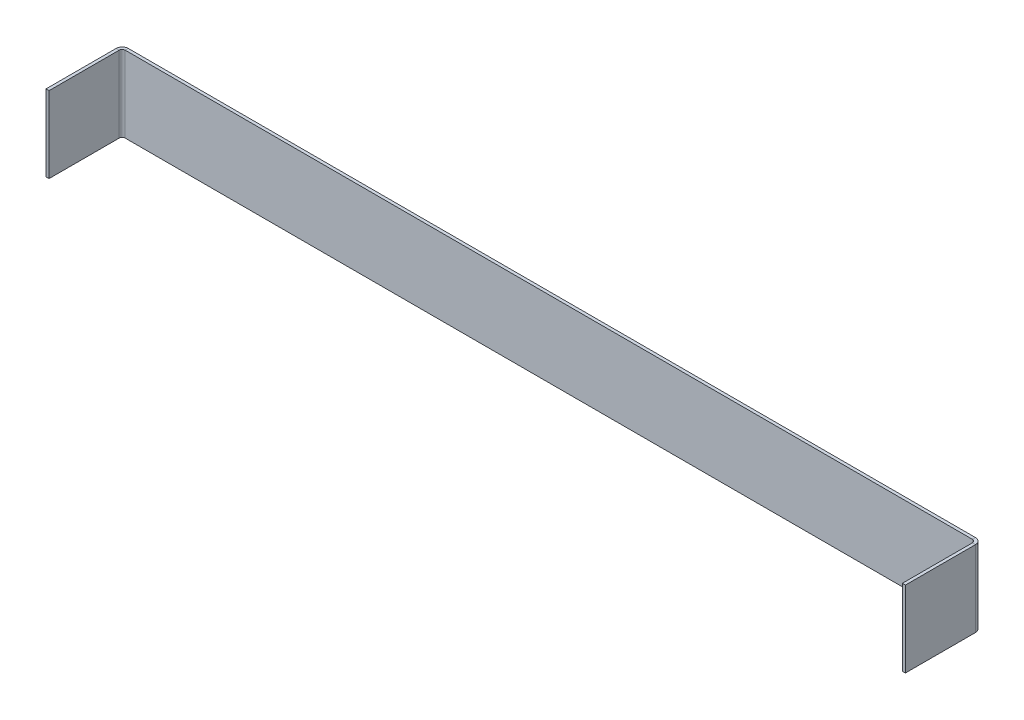
ISO-10303-21;
HEADER;
FILE_DESCRIPTION(('STEP AP214'),'2;1');
FILE_NAME('part.step','',(''),(''),'','','');
FILE_SCHEMA(('AUTOMOTIVE_DESIGN { 1 0 10303 214 1 1 1 1 }'));
ENDSEC;
DATA;
#1=APPLICATION_CONTEXT('core data for automotive mechanical design processes');
#2=APPLICATION_PROTOCOL_DEFINITION('international standard','automotive_design',2000,#1);
#3=PRODUCT_CONTEXT('',#1,'mechanical');
#4=PRODUCT('Part','Part','',(#3));
#5=PRODUCT_RELATED_PRODUCT_CATEGORY('part','',(#4));
#6=PRODUCT_DEFINITION_FORMATION('','',#4);
#7=PRODUCT_DEFINITION_CONTEXT('part definition',#1,'design');
#8=PRODUCT_DEFINITION('design','',#6,#7);
#9=PRODUCT_DEFINITION_SHAPE('','',#8);
#10=(LENGTH_UNIT() NAMED_UNIT(*) SI_UNIT(.MILLI.,.METRE.));
#11=(NAMED_UNIT(*) PLANE_ANGLE_UNIT() SI_UNIT($,.RADIAN.));
#12=(NAMED_UNIT(*) SI_UNIT($,.STERADIAN.) SOLID_ANGLE_UNIT());
#13=UNCERTAINTY_MEASURE_WITH_UNIT(LENGTH_MEASURE(1.E-05),#10,'distance_accuracy_value','');
#14=(GEOMETRIC_REPRESENTATION_CONTEXT(3) GLOBAL_UNCERTAINTY_ASSIGNED_CONTEXT((#13)) GLOBAL_UNIT_ASSIGNED_CONTEXT((#10,
#11,#12)) REPRESENTATION_CONTEXT('',''));
#15=CARTESIAN_POINT('',(0.,0.,0.));
#16=DIRECTION('',(0.,0.,1.));
#17=DIRECTION('',(1.,0.,0.));
#18=AXIS2_PLACEMENT_3D('',#15,#16,#17);
#19=CARTESIAN_POINT('',(0.,0.,2.));
#20=DIRECTION('',(0.,1.,0.));
#21=DIRECTION('',(0.,0.,1.));
#22=AXIS2_PLACEMENT_3D('',#19,#20,#21);
#23=PLANE('',#22);
#24=DIRECTION('',(0.,0.,-1.));
#25=VECTOR('',#24,1.);
#26=CARTESIAN_POINT('',(560.,0.,2.00000000000001));
#27=LINE('',#26,#25);
#28=CARTESIAN_POINT('',(560.,0.,2.00000000000001));
#29=VERTEX_POINT('',#28);
#30=CARTESIAN_POINT('',(560.,0.,0.));
#31=VERTEX_POINT('',#30);
#32=EDGE_CURVE('E226',#29,#31,#27,.T.);
#33=ORIENTED_EDGE('',*,*,#32,.F.);
#34=DIRECTION('',(1.,0.,0.));
#35=VECTOR('',#34,1.);
#36=CARTESIAN_POINT('',(0.,0.,2.));
#37=LINE('',#36,#35);
#38=CARTESIAN_POINT('',(3.99999999999999,0.,2.));
#39=VERTEX_POINT('',#38);
#40=EDGE_CURVE('E87',#39,#29,#37,.T.);
#41=ORIENTED_EDGE('',*,*,#40,.F.);
#42=DIRECTION('',(0.,0.,-1.));
#43=VECTOR('',#42,1.);
#44=CARTESIAN_POINT('',(3.99999999999999,0.,2.));
#45=LINE('',#44,#43);
#46=CARTESIAN_POINT('',(3.99999999999999,0.,0.));
#47=VERTEX_POINT('',#46);
#48=EDGE_CURVE('E267',#39,#47,#45,.T.);
#49=ORIENTED_EDGE('',*,*,#48,.T.);
#50=DIRECTION('',(1.,0.,0.));
#51=VECTOR('',#50,1.);
#52=CARTESIAN_POINT('',(0.,0.,0.));
#53=LINE('',#52,#51);
#54=EDGE_CURVE('E281',#47,#31,#53,.T.);
#55=ORIENTED_EDGE('',*,*,#54,.T.);
#56=EDGE_LOOP('',(#33,#41,#49,#55));
#57=FACE_BOUND('',#56,.T.);
#58=ADVANCED_FACE('F79',(#57),#23,.F.);
#59=CARTESIAN_POINT('',(0.,50.,2.));
#60=DIRECTION('',(0.,-1.,0.));
#61=DIRECTION('',(0.,0.,-1.));
#62=AXIS2_PLACEMENT_3D('',#59,#60,#61);
#63=PLANE('',#62);
#64=DIRECTION('',(0.,0.,-1.));
#65=VECTOR('',#64,1.);
#66=CARTESIAN_POINT('',(560.,50.,2.00000000000001));
#67=LINE('',#66,#65);
#68=CARTESIAN_POINT('',(560.,50.,2.00000000000001));
#69=VERTEX_POINT('',#68);
#70=CARTESIAN_POINT('',(560.,50.,0.));
#71=VERTEX_POINT('',#70);
#72=EDGE_CURVE('E215',#69,#71,#67,.T.);
#73=ORIENTED_EDGE('',*,*,#72,.T.);
#74=DIRECTION('',(-1.,0.,0.));
#75=VECTOR('',#74,1.);
#76=CARTESIAN_POINT('',(0.,50.,0.));
#77=LINE('',#76,#75);
#78=CARTESIAN_POINT('',(3.99999999999999,50.,0.));
#79=VERTEX_POINT('',#78);
#80=EDGE_CURVE('E82',#71,#79,#77,.T.);
#81=ORIENTED_EDGE('',*,*,#80,.T.);
#82=DIRECTION('',(0.,0.,-1.));
#83=VECTOR('',#82,1.);
#84=CARTESIAN_POINT('',(3.99999999999999,50.,2.));
#85=LINE('',#84,#83);
#86=CARTESIAN_POINT('',(3.99999999999999,50.,2.));
#87=VERTEX_POINT('',#86);
#88=EDGE_CURVE('E278',#87,#79,#85,.T.);
#89=ORIENTED_EDGE('',*,*,#88,.F.);
#90=DIRECTION('',(-1.,0.,0.));
#91=VECTOR('',#90,1.);
#92=CARTESIAN_POINT('',(0.,50.,2.));
#93=LINE('',#92,#91);
#94=EDGE_CURVE('E13',#69,#87,#93,.T.);
#95=ORIENTED_EDGE('',*,*,#94,.F.);
#96=EDGE_LOOP('',(#73,#81,#89,#95));
#97=FACE_BOUND('',#96,.T.);
#98=ADVANCED_FACE('F298',(#97),#63,.F.);
#99=CARTESIAN_POINT('',(0.,0.,2.));
#100=DIRECTION('',(0.,0.,-1.));
#101=DIRECTION('',(-1.,0.,0.));
#102=AXIS2_PLACEMENT_3D('',#99,#100,#101);
#103=PLANE('',#102);
#104=DIRECTION('',(0.,1.,0.));
#105=VECTOR('',#104,1.);
#106=CARTESIAN_POINT('',(560.,50.,2.00000000000001));
#107=LINE('',#106,#105);
#108=EDGE_CURVE('E221',#69,#29,#107,.F.);
#109=ORIENTED_EDGE('',*,*,#108,.F.);
#110=ORIENTED_EDGE('',*,*,#94,.T.);
#111=DIRECTION('',(0.,-1.,0.));
#112=VECTOR('',#111,1.);
#113=CARTESIAN_POINT('',(3.99999999999999,0.,2.));
#114=LINE('',#113,#112);
#115=EDGE_CURVE('E273',#39,#87,#114,.F.);
#116=ORIENTED_EDGE('',*,*,#115,.F.);
#117=ORIENTED_EDGE('',*,*,#40,.T.);
#118=EDGE_LOOP('',(#109,#110,#116,#117));
#119=FACE_BOUND('',#118,.T.);
#120=ADVANCED_FACE('F302',(#119),#103,.F.);
#121=CARTESIAN_POINT('',(0.,0.,0.));
#122=DIRECTION('',(0.,0.,-1.));
#123=DIRECTION('',(-1.,0.,0.));
#124=AXIS2_PLACEMENT_3D('',#121,#122,#123);
#125=PLANE('',#124);
#126=ORIENTED_EDGE('',*,*,#80,.F.);
#127=DIRECTION('',(0.,1.,0.));
#128=VECTOR('',#127,1.);
#129=CARTESIAN_POINT('',(560.,50.,0.));
#130=LINE('',#129,#128);
#131=EDGE_CURVE('E210',#71,#31,#130,.F.);
#132=ORIENTED_EDGE('',*,*,#131,.T.);
#133=ORIENTED_EDGE('',*,*,#54,.F.);
#134=DIRECTION('',(0.,-1.,0.));
#135=VECTOR('',#134,1.);
#136=CARTESIAN_POINT('',(3.99999999999999,0.,0.));
#137=LINE('',#136,#135);
#138=EDGE_CURVE('E260',#47,#79,#137,.F.);
#139=ORIENTED_EDGE('',*,*,#138,.T.);
#140=EDGE_LOOP('',(#126,#132,#133,#139));
#141=FACE_BOUND('',#140,.T.);
#142=ADVANCED_FACE('F291',(#141),#125,.T.);
#143=CARTESIAN_POINT('',(3.99999999999999,50.,4.));
#144=DIRECTION('',(0.,1.,0.));
#145=DIRECTION('',(0.,0.,1.));
#146=AXIS2_PLACEMENT_3D('',#143,#144,#145);
#147=PLANE('',#146);
#148=DIRECTION('',(1.,0.,0.));
#149=VECTOR('',#148,1.);
#150=CARTESIAN_POINT('',(0.,50.,3.99999999999999));
#151=LINE('',#150,#149);
#152=CARTESIAN_POINT('',(1.99999999999999,50.,3.99999999999999));
#153=VERTEX_POINT('',#152);
#154=CARTESIAN_POINT('',(0.,50.,3.99999999999999));
#155=VERTEX_POINT('',#154);
#156=EDGE_CURVE('E228',#153,#155,#151,.F.);
#157=ORIENTED_EDGE('',*,*,#156,.F.);
#158=CARTESIAN_POINT('',(3.99999999999999,50.,4.));
#159=DIRECTION('',(0.,-1.,0.));
#160=DIRECTION('',(0.,0.,-1.));
#161=AXIS2_PLACEMENT_3D('',#158,#159,#160);
#162=CIRCLE('',#161,2.);
#163=EDGE_CURVE('E270',#87,#153,#162,.F.);
#164=ORIENTED_EDGE('',*,*,#163,.F.);
#165=ORIENTED_EDGE('',*,*,#88,.T.);
#166=CARTESIAN_POINT('',(3.99999999999999,50.,4.));
#167=DIRECTION('',(0.,-1.,0.));
#168=DIRECTION('',(0.,0.,-1.));
#169=AXIS2_PLACEMENT_3D('',#166,#167,#168);
#170=CIRCLE('',#169,4.);
#171=EDGE_CURVE('E263',#79,#155,#170,.F.);
#172=ORIENTED_EDGE('',*,*,#171,.T.);
#173=EDGE_LOOP('',(#157,#164,#165,#172));
#174=FACE_BOUND('',#173,.T.);
#175=ADVANCED_FACE('F309',(#174),#147,.T.);
#176=CARTESIAN_POINT('',(3.99999999999999,0.,4.));
#177=DIRECTION('',(0.,1.,0.));
#178=DIRECTION('',(0.,0.,1.));
#179=AXIS2_PLACEMENT_3D('',#176,#177,#178);
#180=PLANE('',#179);
#181=CARTESIAN_POINT('',(3.99999999999999,0.,4.));
#182=DIRECTION('',(0.,-1.,0.));
#183=DIRECTION('',(0.,0.,-1.));
#184=AXIS2_PLACEMENT_3D('',#181,#182,#183);
#185=CIRCLE('',#184,2.);
#186=CARTESIAN_POINT('',(1.99999999999999,0.,3.99999999999999));
#187=VERTEX_POINT('',#186);
#188=EDGE_CURVE('E233',#187,#39,#185,.T.);
#189=ORIENTED_EDGE('',*,*,#188,.F.);
#190=DIRECTION('',(1.,0.,0.));
#191=VECTOR('',#190,1.);
#192=CARTESIAN_POINT('',(1.99999999999999,0.,3.99999999999999));
#193=LINE('',#192,#191);
#194=CARTESIAN_POINT('',(0.,0.,3.99999999999999));
#195=VERTEX_POINT('',#194);
#196=EDGE_CURVE('E253',#187,#195,#193,.F.);
#197=ORIENTED_EDGE('',*,*,#196,.T.);
#198=CARTESIAN_POINT('',(3.99999999999999,0.,4.));
#199=DIRECTION('',(0.,-1.,0.));
#200=DIRECTION('',(0.,0.,-1.));
#201=AXIS2_PLACEMENT_3D('',#198,#199,#200);
#202=CIRCLE('',#201,4.);
#203=EDGE_CURVE('E264',#195,#47,#202,.T.);
#204=ORIENTED_EDGE('',*,*,#203,.T.);
#205=ORIENTED_EDGE('',*,*,#48,.F.);
#206=EDGE_LOOP('',(#189,#197,#204,#205));
#207=FACE_BOUND('',#206,.T.);
#208=ADVANCED_FACE('F329',(#207),#180,.F.);
#209=CARTESIAN_POINT('',(3.99999999999999,0.,4.));
#210=DIRECTION('',(0.,-1.,0.));
#211=DIRECTION('',(-1.,0.,0.));
#212=AXIS2_PLACEMENT_3D('',#209,#210,#211);
#213=CYLINDRICAL_SURFACE('',#212,4.);
#214=ORIENTED_EDGE('',*,*,#138,.F.);
#215=ORIENTED_EDGE('',*,*,#203,.F.);
#216=DIRECTION('',(0.,-1.,0.));
#217=VECTOR('',#216,1.);
#218=CARTESIAN_POINT('',(0.,50.,3.99999999999999));
#219=LINE('',#218,#217);
#220=EDGE_CURVE('E251',#195,#155,#219,.F.);
#221=ORIENTED_EDGE('',*,*,#220,.T.);
#222=ORIENTED_EDGE('',*,*,#171,.F.);
#223=EDGE_LOOP('',(#214,#215,#221,#222));
#224=FACE_BOUND('',#223,.T.);
#225=ADVANCED_FACE('F354',(#224),#213,.T.);
#226=CARTESIAN_POINT('',(3.99999999999999,0.,4.));
#227=DIRECTION('',(0.,-1.,0.));
#228=DIRECTION('',(-1.,0.,0.));
#229=AXIS2_PLACEMENT_3D('',#226,#227,#228);
#230=CYLINDRICAL_SURFACE('',#229,2.);
#231=ORIENTED_EDGE('',*,*,#115,.T.);
#232=ORIENTED_EDGE('',*,*,#163,.T.);
#233=DIRECTION('',(0.,-1.,0.));
#234=VECTOR('',#233,1.);
#235=CARTESIAN_POINT('',(1.99999999999999,50.,3.99999999999999));
#236=LINE('',#235,#234);
#237=EDGE_CURVE('E256',#153,#187,#236,.T.);
#238=ORIENTED_EDGE('',*,*,#237,.T.);
#239=ORIENTED_EDGE('',*,*,#188,.T.);
#240=EDGE_LOOP('',(#231,#232,#238,#239));
#241=FACE_BOUND('',#240,.T.);
#242=ADVANCED_FACE('F305',(#241),#230,.F.);
#243=CARTESIAN_POINT('',(0.,50.,1.99999999999999));
#244=DIRECTION('',(0.,-1.,0.));
#245=DIRECTION('',(0.,0.,-1.));
#246=AXIS2_PLACEMENT_3D('',#243,#244,#245);
#247=PLANE('',#246);
#248=ORIENTED_EDGE('',*,*,#156,.T.);
#249=DIRECTION('',(0.,0.,-1.));
#250=VECTOR('',#249,1.);
#251=CARTESIAN_POINT('',(0.,50.,0.));
#252=LINE('',#251,#250);
#253=CARTESIAN_POINT('',(-1.6763517303825E-13,50.,50.));
#254=VERTEX_POINT('',#253);
#255=EDGE_CURVE('E241',#254,#155,#252,.T.);
#256=ORIENTED_EDGE('',*,*,#255,.F.);
#257=DIRECTION('',(1.,0.,0.));
#258=VECTOR('',#257,1.);
#259=CARTESIAN_POINT('',(-1.6759110426447E-13,50.,50.));
#260=LINE('',#259,#258);
#261=CARTESIAN_POINT('',(1.99999999999983,50.,50.));
#262=VERTEX_POINT('',#261);
#263=EDGE_CURVE('E234',#254,#262,#260,.T.);
#264=ORIENTED_EDGE('',*,*,#263,.T.);
#265=DIRECTION('',(0.,0.,1.));
#266=VECTOR('',#265,1.);
#267=CARTESIAN_POINT('',(2.,50.,2.));
#268=LINE('',#267,#266);
#269=EDGE_CURVE('E248',#262,#153,#268,.F.);
#270=ORIENTED_EDGE('',*,*,#269,.T.);
#271=EDGE_LOOP('',(#248,#256,#264,#270));
#272=FACE_BOUND('',#271,.T.);
#273=ADVANCED_FACE('F312',(#272),#247,.F.);
#274=CARTESIAN_POINT('',(-1.67400815431762E-13,0.,50.));
#275=DIRECTION('',(0.,1.,0.));
#276=DIRECTION('',(0.,0.,1.));
#277=AXIS2_PLACEMENT_3D('',#274,#275,#276);
#278=PLANE('',#277);
#279=ORIENTED_EDGE('',*,*,#196,.F.);
#280=DIRECTION('',(0.,0.,-1.));
#281=VECTOR('',#280,1.);
#282=CARTESIAN_POINT('',(1.99999999999983,0.,50.));
#283=LINE('',#282,#281);
#284=CARTESIAN_POINT('',(1.99999999999983,0.,50.));
#285=VERTEX_POINT('',#284);
#286=EDGE_CURVE('E246',#187,#285,#283,.F.);
#287=ORIENTED_EDGE('',*,*,#286,.T.);
#288=DIRECTION('',(1.,0.,0.));
#289=VECTOR('',#288,1.);
#290=CARTESIAN_POINT('',(-1.67400815431762E-13,0.,50.));
#291=LINE('',#290,#289);
#292=CARTESIAN_POINT('',(-1.6763517303825E-13,0.,50.));
#293=VERTEX_POINT('',#292);
#294=EDGE_CURVE('E230',#293,#285,#291,.T.);
#295=ORIENTED_EDGE('',*,*,#294,.F.);
#296=DIRECTION('',(0.,0.,1.));
#297=VECTOR('',#296,1.);
#298=CARTESIAN_POINT('',(0.,0.,0.));
#299=LINE('',#298,#297);
#300=EDGE_CURVE('E239',#195,#293,#299,.T.);
#301=ORIENTED_EDGE('',*,*,#300,.F.);
#302=EDGE_LOOP('',(#279,#287,#295,#301));
#303=FACE_BOUND('',#302,.T.);
#304=ADVANCED_FACE('F331',(#303),#278,.F.);
#305=CARTESIAN_POINT('',(0.,0.,0.));
#306=DIRECTION('',(1.,0.,0.));
#307=DIRECTION('',(0.,0.,-1.));
#308=AXIS2_PLACEMENT_3D('',#305,#306,#307);
#309=PLANE('',#308);
#310=ORIENTED_EDGE('',*,*,#220,.F.);
#311=ORIENTED_EDGE('',*,*,#300,.T.);
#312=DIRECTION('',(0.,1.,0.));
#313=VECTOR('',#312,1.);
#314=CARTESIAN_POINT('',(-1.6763517303825E-13,0.,50.));
#315=LINE('',#314,#313);
#316=EDGE_CURVE('E237',#293,#254,#315,.T.);
#317=ORIENTED_EDGE('',*,*,#316,.T.);
#318=ORIENTED_EDGE('',*,*,#255,.T.);
#319=EDGE_LOOP('',(#310,#311,#317,#318));
#320=FACE_BOUND('',#319,.T.);
#321=ADVANCED_FACE('F316',(#320),#309,.F.);
#322=CARTESIAN_POINT('',(2.00000000000001,0.,0.));
#323=DIRECTION('',(1.,0.,0.));
#324=DIRECTION('',(0.,0.,-1.));
#325=AXIS2_PLACEMENT_3D('',#322,#323,#324);
#326=PLANE('',#325);
#327=ORIENTED_EDGE('',*,*,#286,.F.);
#328=ORIENTED_EDGE('',*,*,#237,.F.);
#329=ORIENTED_EDGE('',*,*,#269,.F.);
#330=DIRECTION('',(0.,-1.,0.));
#331=VECTOR('',#330,1.);
#332=CARTESIAN_POINT('',(1.99999999999983,50.,50.));
#333=LINE('',#332,#331);
#334=EDGE_CURVE('E244',#285,#262,#333,.F.);
#335=ORIENTED_EDGE('',*,*,#334,.F.);
#336=EDGE_LOOP('',(#327,#328,#329,#335));
#337=FACE_BOUND('',#336,.T.);
#338=ADVANCED_FACE('F326',(#337),#326,.T.);
#339=CARTESIAN_POINT('',(-1.67400815431762E-13,50.,50.));
#340=DIRECTION('',(0.,0.,-1.));
#341=DIRECTION('',(-1.,0.,0.));
#342=AXIS2_PLACEMENT_3D('',#339,#340,#341);
#343=PLANE('',#342);
#344=ORIENTED_EDGE('',*,*,#334,.T.);
#345=ORIENTED_EDGE('',*,*,#263,.F.);
#346=ORIENTED_EDGE('',*,*,#316,.F.);
#347=ORIENTED_EDGE('',*,*,#294,.T.);
#348=EDGE_LOOP('',(#344,#345,#346,#347));
#349=FACE_BOUND('',#348,.T.);
#350=ADVANCED_FACE('F322',(#349),#343,.F.);
#351=CARTESIAN_POINT('',(560.,0.,4.00000000000001));
#352=DIRECTION('',(0.,-1.,0.));
#353=DIRECTION('',(0.,0.,-1.));
#354=AXIS2_PLACEMENT_3D('',#351,#352,#353);
#355=PLANE('',#354);
#356=DIRECTION('',(-1.,0.,0.));
#357=VECTOR('',#356,1.);
#358=CARTESIAN_POINT('',(564.,0.,3.99999999999999));
#359=LINE('',#358,#357);
#360=CARTESIAN_POINT('',(562.,0.,4.));
#361=VERTEX_POINT('',#360);
#362=CARTESIAN_POINT('',(564.,0.,3.99999999999999));
#363=VERTEX_POINT('',#362);
#364=EDGE_CURVE('E193',#361,#363,#359,.F.);
#365=ORIENTED_EDGE('',*,*,#364,.F.);
#366=CARTESIAN_POINT('',(560.,0.,4.00000000000001));
#367=DIRECTION('',(0.,1.,0.));
#368=DIRECTION('',(0.,0.,1.));
#369=AXIS2_PLACEMENT_3D('',#366,#367,#368);
#370=CIRCLE('',#369,2.);
#371=EDGE_CURVE('E218',#29,#361,#370,.F.);
#372=ORIENTED_EDGE('',*,*,#371,.F.);
#373=ORIENTED_EDGE('',*,*,#32,.T.);
#374=CARTESIAN_POINT('',(560.,0.,4.00000000000001));
#375=DIRECTION('',(0.,1.,0.));
#376=DIRECTION('',(0.,0.,1.));
#377=AXIS2_PLACEMENT_3D('',#374,#375,#376);
#378=CIRCLE('',#377,4.);
#379=EDGE_CURVE('E95',#31,#363,#378,.F.);
#380=ORIENTED_EDGE('',*,*,#379,.T.);
#381=EDGE_LOOP('',(#365,#372,#373,#380));
#382=FACE_BOUND('',#381,.T.);
#383=ADVANCED_FACE('F403',(#382),#355,.T.);
#384=CARTESIAN_POINT('',(560.,50.,4.00000000000001));
#385=DIRECTION('',(0.,-1.,0.));
#386=DIRECTION('',(0.,0.,-1.));
#387=AXIS2_PLACEMENT_3D('',#384,#385,#386);
#388=PLANE('',#387);
#389=CARTESIAN_POINT('',(560.,50.,4.00000000000001));
#390=DIRECTION('',(0.,1.,0.));
#391=DIRECTION('',(0.,0.,1.));
#392=AXIS2_PLACEMENT_3D('',#389,#390,#391);
#393=CIRCLE('',#392,2.);
#394=CARTESIAN_POINT('',(562.,50.,4.));
#395=VERTEX_POINT('',#394);
#396=EDGE_CURVE('E223',#395,#69,#393,.T.);
#397=ORIENTED_EDGE('',*,*,#396,.F.);
#398=DIRECTION('',(-1.,0.,0.));
#399=VECTOR('',#398,1.);
#400=CARTESIAN_POINT('',(562.,50.,4.));
#401=LINE('',#400,#399);
#402=CARTESIAN_POINT('',(564.,50.,3.99999999999999));
#403=VERTEX_POINT('',#402);
#404=EDGE_CURVE('E204',#395,#403,#401,.F.);
#405=ORIENTED_EDGE('',*,*,#404,.T.);
#406=CARTESIAN_POINT('',(560.,50.,4.00000000000001));
#407=DIRECTION('',(0.,1.,0.));
#408=DIRECTION('',(0.,0.,1.));
#409=AXIS2_PLACEMENT_3D('',#406,#407,#408);
#410=CIRCLE('',#409,4.);
#411=EDGE_CURVE('E213',#403,#71,#410,.T.);
#412=ORIENTED_EDGE('',*,*,#411,.T.);
#413=ORIENTED_EDGE('',*,*,#72,.F.);
#414=EDGE_LOOP('',(#397,#405,#412,#413));
#415=FACE_BOUND('',#414,.T.);
#416=ADVANCED_FACE('F295',(#415),#388,.F.);
#417=CARTESIAN_POINT('',(560.,50.,4.00000000000001));
#418=DIRECTION('',(0.,1.,0.));
#419=DIRECTION('',(1.,0.,0.));
#420=AXIS2_PLACEMENT_3D('',#417,#418,#419);
#421=CYLINDRICAL_SURFACE('',#420,4.);
#422=ORIENTED_EDGE('',*,*,#131,.F.);
#423=ORIENTED_EDGE('',*,*,#411,.F.);
#424=DIRECTION('',(0.,1.,0.));
#425=VECTOR('',#424,1.);
#426=CARTESIAN_POINT('',(564.,0.,3.99999999999999));
#427=LINE('',#426,#425);
#428=EDGE_CURVE('E202',#403,#363,#427,.F.);
#429=ORIENTED_EDGE('',*,*,#428,.T.);
#430=ORIENTED_EDGE('',*,*,#379,.F.);
#431=EDGE_LOOP('',(#422,#423,#429,#430));
#432=FACE_BOUND('',#431,.T.);
#433=ADVANCED_FACE('F292',(#432),#421,.T.);
#434=CARTESIAN_POINT('',(560.,50.,4.00000000000001));
#435=DIRECTION('',(0.,1.,0.));
#436=DIRECTION('',(1.,0.,0.));
#437=AXIS2_PLACEMENT_3D('',#434,#435,#436);
#438=CYLINDRICAL_SURFACE('',#437,2.);
#439=ORIENTED_EDGE('',*,*,#108,.T.);
#440=ORIENTED_EDGE('',*,*,#371,.T.);
#441=DIRECTION('',(0.,1.,0.));
#442=VECTOR('',#441,1.);
#443=CARTESIAN_POINT('',(562.,0.,4.));
#444=LINE('',#443,#442);
#445=EDGE_CURVE('E207',#361,#395,#444,.T.);
#446=ORIENTED_EDGE('',*,*,#445,.T.);
#447=ORIENTED_EDGE('',*,*,#396,.T.);
#448=EDGE_LOOP('',(#439,#440,#446,#447));
#449=FACE_BOUND('',#448,.T.);
#450=ADVANCED_FACE('F456',(#449),#438,.F.);
#451=CARTESIAN_POINT('',(564.,0.,1.99999999999999));
#452=DIRECTION('',(0.,1.,0.));
#453=DIRECTION('',(0.,0.,1.));
#454=AXIS2_PLACEMENT_3D('',#451,#452,#453);
#455=PLANE('',#454);
#456=ORIENTED_EDGE('',*,*,#364,.T.);
#457=DIRECTION('',(0.,0.,-1.));
#458=VECTOR('',#457,1.);
#459=CARTESIAN_POINT('',(564.,0.,-2.6160070705468E-12));
#460=LINE('',#459,#458);
#461=CARTESIAN_POINT('',(564.,0.,50.));
#462=VERTEX_POINT('',#461);
#463=EDGE_CURVE('E174',#462,#363,#460,.T.);
#464=ORIENTED_EDGE('',*,*,#463,.F.);
#465=DIRECTION('',(-1.,0.,0.));
#466=VECTOR('',#465,1.);
#467=CARTESIAN_POINT('',(564.,0.,50.));
#468=LINE('',#467,#466);
#469=CARTESIAN_POINT('',(562.,0.,50.));
#470=VERTEX_POINT('',#469);
#471=EDGE_CURVE('E180',#462,#470,#468,.T.);
#472=ORIENTED_EDGE('',*,*,#471,.T.);
#473=DIRECTION('',(0.,0.,1.));
#474=VECTOR('',#473,1.);
#475=CARTESIAN_POINT('',(562.,0.,2.));
#476=LINE('',#475,#474);
#477=EDGE_CURVE('E200',#470,#361,#476,.F.);
#478=ORIENTED_EDGE('',*,*,#477,.T.);
#479=EDGE_LOOP('',(#456,#464,#472,#478));
#480=FACE_BOUND('',#479,.T.);
#481=ADVANCED_FACE('F192',(#480),#455,.F.);
#482=CARTESIAN_POINT('',(564.,50.,50.));
#483=DIRECTION('',(0.,-1.,0.));
#484=DIRECTION('',(0.,0.,-1.));
#485=AXIS2_PLACEMENT_3D('',#482,#483,#484);
#486=PLANE('',#485);
#487=ORIENTED_EDGE('',*,*,#404,.F.);
#488=DIRECTION('',(0.,0.,-1.));
#489=VECTOR('',#488,1.);
#490=CARTESIAN_POINT('',(562.,50.,50.));
#491=LINE('',#490,#489);
#492=CARTESIAN_POINT('',(562.,50.,50.));
#493=VERTEX_POINT('',#492);
#494=EDGE_CURVE('E196',#395,#493,#491,.F.);
#495=ORIENTED_EDGE('',*,*,#494,.T.);
#496=DIRECTION('',(-1.,0.,0.));
#497=VECTOR('',#496,1.);
#498=CARTESIAN_POINT('',(564.,50.,50.));
#499=LINE('',#498,#497);
#500=CARTESIAN_POINT('',(564.,50.,50.));
#501=VERTEX_POINT('',#500);
#502=EDGE_CURVE('E189',#501,#493,#499,.T.);
#503=ORIENTED_EDGE('',*,*,#502,.F.);
#504=DIRECTION('',(0.,0.,1.));
#505=VECTOR('',#504,1.);
#506=CARTESIAN_POINT('',(564.,50.,-2.6160070705468E-12));
#507=LINE('',#506,#505);
#508=EDGE_CURVE('E176',#403,#501,#507,.T.);
#509=ORIENTED_EDGE('',*,*,#508,.F.);
#510=EDGE_LOOP('',(#487,#495,#503,#509));
#511=FACE_BOUND('',#510,.T.);
#512=ADVANCED_FACE('F476',(#511),#486,.F.);
#513=CARTESIAN_POINT('',(564.,0.,-2.6160070705468E-12));
#514=DIRECTION('',(-1.,0.,0.));
#515=DIRECTION('',(0.,0.,1.));
#516=AXIS2_PLACEMENT_3D('',#513,#514,#515);
#517=PLANE('',#516);
#518=ORIENTED_EDGE('',*,*,#428,.F.);
#519=ORIENTED_EDGE('',*,*,#508,.T.);
#520=DIRECTION('',(0.,-1.,0.));
#521=VECTOR('',#520,1.);
#522=CARTESIAN_POINT('',(564.,0.,50.));
#523=LINE('',#522,#521);
#524=EDGE_CURVE('E169',#501,#462,#523,.T.);
#525=ORIENTED_EDGE('',*,*,#524,.T.);
#526=ORIENTED_EDGE('',*,*,#463,.T.);
#527=EDGE_LOOP('',(#518,#519,#525,#526));
#528=FACE_BOUND('',#527,.T.);
#529=ADVANCED_FACE('F172',(#528),#517,.F.);
#530=CARTESIAN_POINT('',(562.,0.,-2.60902410786912E-12));
#531=DIRECTION('',(-1.,0.,0.));
#532=DIRECTION('',(0.,0.,1.));
#533=AXIS2_PLACEMENT_3D('',#530,#531,#532);
#534=PLANE('',#533);
#535=ORIENTED_EDGE('',*,*,#494,.F.);
#536=ORIENTED_EDGE('',*,*,#445,.F.);
#537=ORIENTED_EDGE('',*,*,#477,.F.);
#538=DIRECTION('',(0.,1.,0.));
#539=VECTOR('',#538,1.);
#540=CARTESIAN_POINT('',(562.,0.,50.));
#541=LINE('',#540,#539);
#542=EDGE_CURVE('E185',#493,#470,#541,.F.);
#543=ORIENTED_EDGE('',*,*,#542,.F.);
#544=EDGE_LOOP('',(#535,#536,#537,#543));
#545=FACE_BOUND('',#544,.T.);
#546=ADVANCED_FACE('F496',(#545),#534,.T.);
#547=CARTESIAN_POINT('',(564.,0.,50.));
#548=DIRECTION('',(0.,0.,-1.));
#549=DIRECTION('',(-1.,0.,0.));
#550=AXIS2_PLACEMENT_3D('',#547,#548,#549);
#551=PLANE('',#550);
#552=ORIENTED_EDGE('',*,*,#542,.T.);
#553=ORIENTED_EDGE('',*,*,#471,.F.);
#554=ORIENTED_EDGE('',*,*,#524,.F.);
#555=ORIENTED_EDGE('',*,*,#502,.T.);
#556=EDGE_LOOP('',(#552,#553,#554,#555));
#557=FACE_BOUND('',#556,.T.);
#558=ADVANCED_FACE('F183',(#557),#551,.F.);
#559=CLOSED_SHELL('',(#58,#98,#120,#142,#175,#208,#225,#242,#273,#304,#321,#338,#350,#383,#416,
#433,#450,#481,#512,#529,#546,#558));
#560=MANIFOLD_SOLID_BREP('B2',#559);
#561=ADVANCED_BREP_SHAPE_REPRESENTATION('',(#18,#560),#14);
#562=SHAPE_DEFINITION_REPRESENTATION(#9,#561);
ENDSEC;
END-ISO-10303-21;
